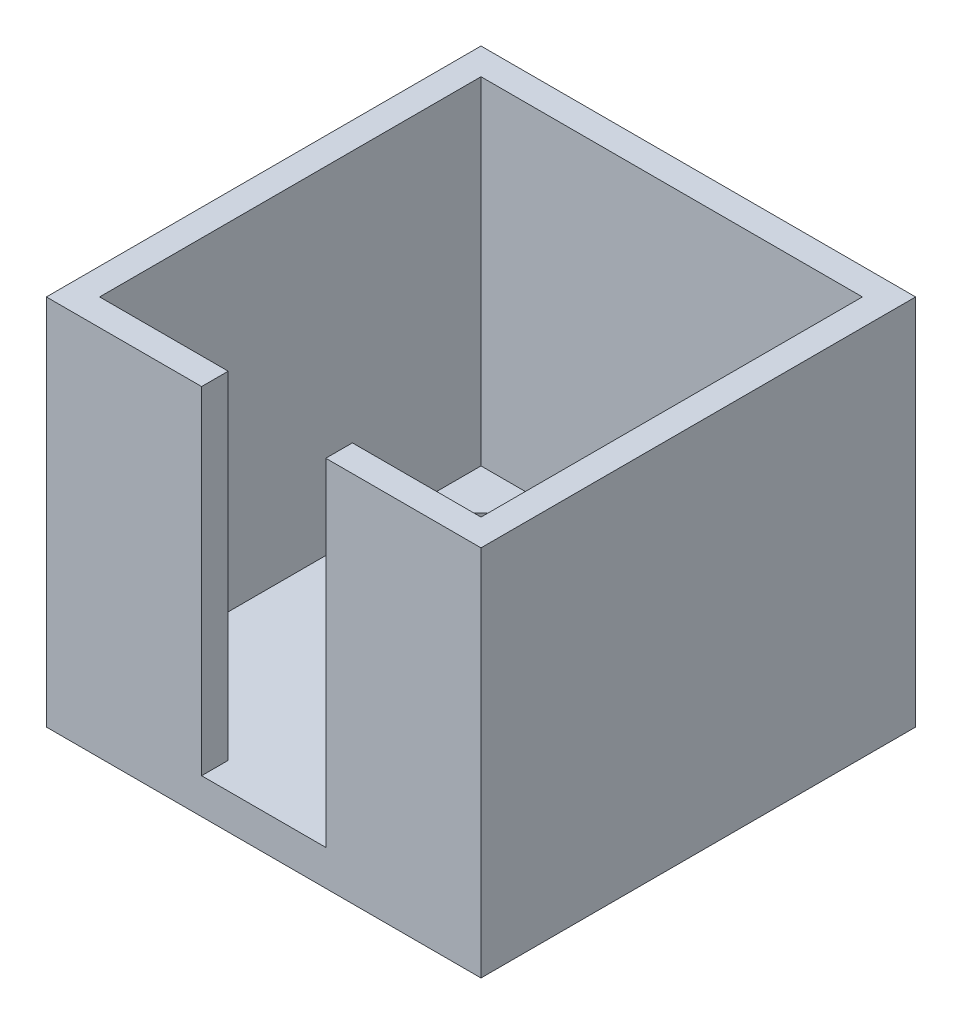
ISO-10303-21;
HEADER;
FILE_DESCRIPTION(('STEP AP214'),'2;1');
FILE_NAME('part.step','',(''),(''),'','','');
FILE_SCHEMA(('AUTOMOTIVE_DESIGN { 1 0 10303 214 1 1 1 1 }'));
ENDSEC;
DATA;
#1=APPLICATION_CONTEXT('core data for automotive mechanical design processes');
#2=APPLICATION_PROTOCOL_DEFINITION('international standard','automotive_design',2000,#1);
#3=PRODUCT_CONTEXT('',#1,'mechanical');
#4=PRODUCT('Part','Part','',(#3));
#5=PRODUCT_RELATED_PRODUCT_CATEGORY('part','',(#4));
#6=PRODUCT_DEFINITION_FORMATION('','',#4);
#7=PRODUCT_DEFINITION_CONTEXT('part definition',#1,'design');
#8=PRODUCT_DEFINITION('design','',#6,#7);
#9=PRODUCT_DEFINITION_SHAPE('','',#8);
#10=(LENGTH_UNIT() NAMED_UNIT(*) SI_UNIT(.MILLI.,.METRE.));
#11=(NAMED_UNIT(*) PLANE_ANGLE_UNIT() SI_UNIT($,.RADIAN.));
#12=(NAMED_UNIT(*) SI_UNIT($,.STERADIAN.) SOLID_ANGLE_UNIT());
#13=UNCERTAINTY_MEASURE_WITH_UNIT(LENGTH_MEASURE(1.E-05),#10,'distance_accuracy_value','');
#14=(GEOMETRIC_REPRESENTATION_CONTEXT(3) GLOBAL_UNCERTAINTY_ASSIGNED_CONTEXT((#13)) GLOBAL_UNIT_ASSIGNED_CONTEXT((#10,
#11,#12)) REPRESENTATION_CONTEXT('',''));
#15=CARTESIAN_POINT('',(0.,0.,0.));
#16=DIRECTION('',(0.,0.,1.));
#17=DIRECTION('',(1.,0.,0.));
#18=AXIS2_PLACEMENT_3D('',#15,#16,#17);
#19=CARTESIAN_POINT('',(14.5,0.,0.));
#20=DIRECTION('',(-1.,0.,0.));
#21=DIRECTION('',(0.,0.,1.));
#22=AXIS2_PLACEMENT_3D('',#19,#20,#21);
#23=PLANE('',#22);
#24=DIRECTION('',(0.,0.,-1.));
#25=VECTOR('',#24,1.);
#26=CARTESIAN_POINT('',(14.5,4.,3.));
#27=LINE('',#26,#25);
#28=CARTESIAN_POINT('',(14.5,4.,3.));
#29=VERTEX_POINT('',#28);
#30=CARTESIAN_POINT('',(14.5,4.,0.));
#31=VERTEX_POINT('',#30);
#32=EDGE_CURVE('E124',#29,#31,#27,.T.);
#33=ORIENTED_EDGE('',*,*,#32,.T.);
#34=DIRECTION('',(0.,-1.,0.));
#35=VECTOR('',#34,1.);
#36=CARTESIAN_POINT('',(14.5,0.,0.));
#37=LINE('',#36,#35);
#38=CARTESIAN_POINT('',(14.5,42.,0.));
#39=VERTEX_POINT('',#38);
#40=EDGE_CURVE('E120',#39,#31,#37,.T.);
#41=ORIENTED_EDGE('',*,*,#40,.F.);
#42=DIRECTION('',(0.,0.,1.));
#43=VECTOR('',#42,1.);
#44=CARTESIAN_POINT('',(14.5,42.,0.));
#45=LINE('',#44,#43);
#46=CARTESIAN_POINT('',(14.5,42.,3.));
#47=VERTEX_POINT('',#46);
#48=EDGE_CURVE('E122',#39,#47,#45,.T.);
#49=ORIENTED_EDGE('',*,*,#48,.T.);
#50=DIRECTION('',(0.,-1.,0.));
#51=VECTOR('',#50,1.);
#52=CARTESIAN_POINT('',(14.5,0.,3.));
#53=LINE('',#52,#51);
#54=EDGE_CURVE('E49',#47,#29,#53,.T.);
#55=ORIENTED_EDGE('',*,*,#54,.T.);
#56=EDGE_LOOP('',(#33,#41,#49,#55));
#57=FACE_BOUND('',#56,.T.);
#58=ADVANCED_FACE('F34',(#57),#23,.F.);
#59=CARTESIAN_POINT('',(28.5,0.,0.));
#60=DIRECTION('',(1.,0.,0.));
#61=DIRECTION('',(0.,0.,-1.));
#62=AXIS2_PLACEMENT_3D('',#59,#60,#61);
#63=PLANE('',#62);
#64=DIRECTION('',(0.,0.,-1.));
#65=VECTOR('',#64,1.);
#66=CARTESIAN_POINT('',(28.5,4.,3.));
#67=LINE('',#66,#65);
#68=CARTESIAN_POINT('',(28.5,4.,3.));
#69=VERTEX_POINT('',#68);
#70=CARTESIAN_POINT('',(28.5,4.,0.));
#71=VERTEX_POINT('',#70);
#72=EDGE_CURVE('E56',#69,#71,#67,.T.);
#73=ORIENTED_EDGE('',*,*,#72,.F.);
#74=DIRECTION('',(0.,1.,0.));
#75=VECTOR('',#74,1.);
#76=CARTESIAN_POINT('',(28.5,0.,3.));
#77=LINE('',#76,#75);
#78=CARTESIAN_POINT('',(28.5,42.,3.));
#79=VERTEX_POINT('',#78);
#80=EDGE_CURVE('E130',#69,#79,#77,.T.);
#81=ORIENTED_EDGE('',*,*,#80,.T.);
#82=DIRECTION('',(0.,0.,1.));
#83=VECTOR('',#82,1.);
#84=CARTESIAN_POINT('',(28.5,42.,0.));
#85=LINE('',#84,#83);
#86=CARTESIAN_POINT('',(28.5,42.,0.));
#87=VERTEX_POINT('',#86);
#88=EDGE_CURVE('E129',#87,#79,#85,.T.);
#89=ORIENTED_EDGE('',*,*,#88,.F.);
#90=DIRECTION('',(0.,-1.,0.));
#91=VECTOR('',#90,1.);
#92=CARTESIAN_POINT('',(28.5,42.,0.));
#93=LINE('',#92,#91);
#94=EDGE_CURVE('E11',#87,#71,#93,.T.);
#95=ORIENTED_EDGE('',*,*,#94,.T.);
#96=EDGE_LOOP('',(#73,#81,#89,#95));
#97=FACE_BOUND('',#96,.T.);
#98=ADVANCED_FACE('F264',(#97),#63,.F.);
#99=CARTESIAN_POINT('',(0.,42.,0.));
#100=DIRECTION('',(0.,0.,-1.));
#101=DIRECTION('',(-1.,0.,0.));
#102=AXIS2_PLACEMENT_3D('',#99,#100,#101);
#103=PLANE('',#102);
#104=ORIENTED_EDGE('',*,*,#40,.T.);
#105=DIRECTION('',(1.,0.,0.));
#106=VECTOR('',#105,1.);
#107=CARTESIAN_POINT('',(0.,4.,0.));
#108=LINE('',#107,#106);
#109=CARTESIAN_POINT('',(0.,4.,0.));
#110=VERTEX_POINT('',#109);
#111=EDGE_CURVE('E161',#110,#31,#108,.T.);
#112=ORIENTED_EDGE('',*,*,#111,.F.);
#113=DIRECTION('',(0.,-1.,0.));
#114=VECTOR('',#113,1.);
#115=CARTESIAN_POINT('',(0.,42.,0.));
#116=LINE('',#115,#114);
#117=CARTESIAN_POINT('',(0.,42.,0.));
#118=VERTEX_POINT('',#117);
#119=EDGE_CURVE('E146',#118,#110,#116,.T.);
#120=ORIENTED_EDGE('',*,*,#119,.F.);
#121=DIRECTION('',(1.,0.,0.));
#122=VECTOR('',#121,1.);
#123=CARTESIAN_POINT('',(0.,42.,0.));
#124=LINE('',#123,#122);
#125=EDGE_CURVE('E137',#118,#39,#124,.T.);
#126=ORIENTED_EDGE('',*,*,#125,.T.);
#127=EDGE_LOOP('',(#104,#112,#120,#126));
#128=FACE_BOUND('',#127,.T.);
#129=ADVANCED_FACE('F144',(#128),#103,.T.);
#130=CARTESIAN_POINT('',(46.,4.,0.));
#131=DIRECTION('',(1.,0.,0.));
#132=DIRECTION('',(0.,0.,-1.));
#133=AXIS2_PLACEMENT_3D('',#130,#131,#132);
#134=PLANE('',#133);
#135=DIRECTION('',(0.,0.,1.));
#136=VECTOR('',#135,1.);
#137=CARTESIAN_POINT('',(46.,0.,0.));
#138=LINE('',#137,#136);
#139=CARTESIAN_POINT('',(46.,0.,-46.));
#140=VERTEX_POINT('',#139);
#141=CARTESIAN_POINT('',(46.,0.,3.));
#142=VERTEX_POINT('',#141);
#143=EDGE_CURVE('E200',#140,#142,#138,.T.);
#144=ORIENTED_EDGE('',*,*,#143,.F.);
#145=DIRECTION('',(0.,-1.,0.));
#146=VECTOR('',#145,1.);
#147=CARTESIAN_POINT('',(46.,4.,-46.));
#148=LINE('',#147,#146);
#149=CARTESIAN_POINT('',(46.,42.,-46.));
#150=VERTEX_POINT('',#149);
#151=EDGE_CURVE('E42',#150,#140,#148,.T.);
#152=ORIENTED_EDGE('',*,*,#151,.F.);
#153=DIRECTION('',(0.,0.,-1.));
#154=VECTOR('',#153,1.);
#155=CARTESIAN_POINT('',(46.,42.,-46.));
#156=LINE('',#155,#154);
#157=CARTESIAN_POINT('',(46.,42.,3.));
#158=VERTEX_POINT('',#157);
#159=EDGE_CURVE('E180',#158,#150,#156,.T.);
#160=ORIENTED_EDGE('',*,*,#159,.F.);
#161=DIRECTION('',(0.,-1.,0.));
#162=VECTOR('',#161,1.);
#163=CARTESIAN_POINT('',(46.,4.,3.));
#164=LINE('',#163,#162);
#165=EDGE_CURVE('E194',#158,#142,#164,.T.);
#166=ORIENTED_EDGE('',*,*,#165,.T.);
#167=EDGE_LOOP('',(#144,#152,#160,#166));
#168=FACE_BOUND('',#167,.T.);
#169=ADVANCED_FACE('F223',(#168),#134,.T.);
#170=CARTESIAN_POINT('',(0.,4.,-46.));
#171=DIRECTION('',(0.,0.,-1.));
#172=DIRECTION('',(-1.,0.,0.));
#173=AXIS2_PLACEMENT_3D('',#170,#171,#172);
#174=PLANE('',#173);
#175=DIRECTION('',(1.,0.,0.));
#176=VECTOR('',#175,1.);
#177=CARTESIAN_POINT('',(0.,0.,-46.));
#178=LINE('',#177,#176);
#179=CARTESIAN_POINT('',(-3.,0.,-46.));
#180=VERTEX_POINT('',#179);
#181=EDGE_CURVE('E203',#180,#140,#178,.T.);
#182=ORIENTED_EDGE('',*,*,#181,.F.);
#183=DIRECTION('',(0.,-1.,0.));
#184=VECTOR('',#183,1.);
#185=CARTESIAN_POINT('',(-3.,4.,-46.));
#186=LINE('',#185,#184);
#187=CARTESIAN_POINT('',(-3.,42.,-46.));
#188=VERTEX_POINT('',#187);
#189=EDGE_CURVE('E215',#188,#180,#186,.T.);
#190=ORIENTED_EDGE('',*,*,#189,.F.);
#191=DIRECTION('',(-1.,0.,0.));
#192=VECTOR('',#191,1.);
#193=CARTESIAN_POINT('',(-3.,42.,-46.));
#194=LINE('',#193,#192);
#195=EDGE_CURVE('E183',#150,#188,#194,.T.);
#196=ORIENTED_EDGE('',*,*,#195,.F.);
#197=ORIENTED_EDGE('',*,*,#151,.T.);
#198=EDGE_LOOP('',(#182,#190,#196,#197));
#199=FACE_BOUND('',#198,.T.);
#200=ADVANCED_FACE('F220',(#199),#174,.T.);
#201=CARTESIAN_POINT('',(-3.,4.,0.));
#202=DIRECTION('',(1.,0.,0.));
#203=DIRECTION('',(0.,0.,-1.));
#204=AXIS2_PLACEMENT_3D('',#201,#202,#203);
#205=PLANE('',#204);
#206=DIRECTION('',(0.,0.,1.));
#207=VECTOR('',#206,1.);
#208=CARTESIAN_POINT('',(-3.,0.,0.));
#209=LINE('',#208,#207);
#210=CARTESIAN_POINT('',(-3.,0.,3.));
#211=VERTEX_POINT('',#210);
#212=EDGE_CURVE('E206',#180,#211,#209,.T.);
#213=ORIENTED_EDGE('',*,*,#212,.T.);
#214=DIRECTION('',(0.,-1.,0.));
#215=VECTOR('',#214,1.);
#216=CARTESIAN_POINT('',(-3.,4.,3.));
#217=LINE('',#216,#215);
#218=CARTESIAN_POINT('',(-3.,42.,3.));
#219=VERTEX_POINT('',#218);
#220=EDGE_CURVE('E212',#219,#211,#217,.T.);
#221=ORIENTED_EDGE('',*,*,#220,.F.);
#222=DIRECTION('',(0.,0.,1.));
#223=VECTOR('',#222,1.);
#224=CARTESIAN_POINT('',(-3.,42.,-46.));
#225=LINE('',#224,#223);
#226=EDGE_CURVE('E176',#188,#219,#225,.T.);
#227=ORIENTED_EDGE('',*,*,#226,.F.);
#228=ORIENTED_EDGE('',*,*,#189,.T.);
#229=EDGE_LOOP('',(#213,#221,#227,#228));
#230=FACE_BOUND('',#229,.T.);
#231=ADVANCED_FACE('F230',(#230),#205,.F.);
#232=CARTESIAN_POINT('',(7.07106781186548,4.,-35.9289321881345));
#233=DIRECTION('',(0.,-1.,0.));
#234=DIRECTION('',(0.,0.,-1.));
#235=AXIS2_PLACEMENT_3D('',#232,#233,#234);
#236=CYLINDRICAL_SURFACE('',#235,3.5);
#237=CARTESIAN_POINT('',(7.07106781186548,4.,-35.9289321881345));
#238=DIRECTION('',(0.,1.,0.));
#239=DIRECTION('',(0.,0.,1.));
#240=AXIS2_PLACEMENT_3D('',#237,#238,#239);
#241=CIRCLE('',#240,3.5);
#242=CARTESIAN_POINT('',(7.07106781186548,4.,-32.4289321881345));
#243=VERTEX_POINT('',#242);
#244=EDGE_CURVE('E190',#243,#243,#241,.T.);
#245=ORIENTED_EDGE('',*,*,#244,.T.);
#246=EDGE_LOOP('',(#245));
#247=FACE_BOUND('',#246,.T.);
#248=CARTESIAN_POINT('',(7.07106781186548,0.,-35.9289321881345));
#249=DIRECTION('',(0.,1.,0.));
#250=DIRECTION('',(0.,0.,1.));
#251=AXIS2_PLACEMENT_3D('',#248,#249,#250);
#252=CIRCLE('',#251,3.5);
#253=CARTESIAN_POINT('',(7.07106781186548,0.,-32.4289321881345));
#254=VERTEX_POINT('',#253);
#255=EDGE_CURVE('E197',#254,#254,#252,.T.);
#256=ORIENTED_EDGE('',*,*,#255,.F.);
#257=EDGE_LOOP('',(#256));
#258=FACE_BOUND('',#257,.T.);
#259=ADVANCED_FACE('F291',(#247,#258),#236,.F.);
#260=CARTESIAN_POINT('',(35.9289321881345,4.,-7.07106781186547));
#261=DIRECTION('',(0.,-1.,0.));
#262=DIRECTION('',(0.,0.,-1.));
#263=AXIS2_PLACEMENT_3D('',#260,#261,#262);
#264=CYLINDRICAL_SURFACE('',#263,3.5);
#265=CARTESIAN_POINT('',(35.9289321881345,4.,-7.07106781186547));
#266=DIRECTION('',(0.,1.,0.));
#267=DIRECTION('',(0.,0.,1.));
#268=AXIS2_PLACEMENT_3D('',#265,#266,#267);
#269=CIRCLE('',#268,3.5);
#270=CARTESIAN_POINT('',(35.9289321881345,4.,-3.57106781186547));
#271=VERTEX_POINT('',#270);
#272=EDGE_CURVE('E187',#271,#271,#269,.T.);
#273=ORIENTED_EDGE('',*,*,#272,.T.);
#274=EDGE_LOOP('',(#273));
#275=FACE_BOUND('',#274,.T.);
#276=CARTESIAN_POINT('',(35.9289321881345,0.,-7.07106781186547));
#277=DIRECTION('',(0.,1.,0.));
#278=DIRECTION('',(0.,0.,1.));
#279=AXIS2_PLACEMENT_3D('',#276,#277,#278);
#280=CIRCLE('',#279,3.5);
#281=CARTESIAN_POINT('',(35.9289321881345,0.,-3.57106781186547));
#282=VERTEX_POINT('',#281);
#283=EDGE_CURVE('E186',#282,#282,#280,.T.);
#284=ORIENTED_EDGE('',*,*,#283,.F.);
#285=EDGE_LOOP('',(#284));
#286=FACE_BOUND('',#285,.T.);
#287=ADVANCED_FACE('F36',(#275,#286),#264,.F.);
#288=CARTESIAN_POINT('',(0.,4.,3.));
#289=DIRECTION('',(0.,0.,-1.));
#290=DIRECTION('',(-1.,0.,0.));
#291=AXIS2_PLACEMENT_3D('',#288,#289,#290);
#292=PLANE('',#291);
#293=DIRECTION('',(1.,0.,0.));
#294=VECTOR('',#293,1.);
#295=CARTESIAN_POINT('',(-3.,42.,3.));
#296=LINE('',#295,#294);
#297=EDGE_CURVE('E178',#79,#158,#296,.T.);
#298=ORIENTED_EDGE('',*,*,#297,.F.);
#299=ORIENTED_EDGE('',*,*,#80,.F.);
#300=DIRECTION('',(-1.,0.,0.));
#301=VECTOR('',#300,1.);
#302=CARTESIAN_POINT('',(28.5,4.,3.));
#303=LINE('',#302,#301);
#304=EDGE_CURVE('E238',#69,#29,#303,.T.);
#305=ORIENTED_EDGE('',*,*,#304,.T.);
#306=ORIENTED_EDGE('',*,*,#54,.F.);
#307=EDGE_CURVE('E140',#219,#47,#296,.T.);
#308=ORIENTED_EDGE('',*,*,#307,.F.);
#309=ORIENTED_EDGE('',*,*,#220,.T.);
#310=DIRECTION('',(1.,0.,0.));
#311=VECTOR('',#310,1.);
#312=CARTESIAN_POINT('',(0.,0.,3.));
#313=LINE('',#312,#311);
#314=EDGE_CURVE('E191',#211,#142,#313,.T.);
#315=ORIENTED_EDGE('',*,*,#314,.T.);
#316=ORIENTED_EDGE('',*,*,#165,.F.);
#317=EDGE_LOOP('',(#298,#299,#305,#306,#308,#309,#315,#316));
#318=FACE_BOUND('',#317,.T.);
#319=ADVANCED_FACE('F236',(#318),#292,.F.);
#320=CARTESIAN_POINT('',(0.,4.,0.));
#321=DIRECTION('',(0.,1.,0.));
#322=DIRECTION('',(0.,0.,1.));
#323=AXIS2_PLACEMENT_3D('',#320,#321,#322);
#324=PLANE('',#323);
#325=DIRECTION('',(0.,0.,1.));
#326=VECTOR('',#325,1.);
#327=CARTESIAN_POINT('',(0.,4.,-43.));
#328=LINE('',#327,#326);
#329=CARTESIAN_POINT('',(0.,4.,-43.));
#330=VERTEX_POINT('',#329);
#331=EDGE_CURVE('E141',#330,#110,#328,.T.);
#332=ORIENTED_EDGE('',*,*,#331,.T.);
#333=ORIENTED_EDGE('',*,*,#111,.T.);
#334=ORIENTED_EDGE('',*,*,#32,.F.);
#335=ORIENTED_EDGE('',*,*,#304,.F.);
#336=ORIENTED_EDGE('',*,*,#72,.T.);
#337=CARTESIAN_POINT('',(43.,4.,0.));
#338=VERTEX_POINT('',#337);
#339=EDGE_CURVE('E160',#71,#338,#108,.T.);
#340=ORIENTED_EDGE('',*,*,#339,.T.);
#341=DIRECTION('',(0.,0.,-1.));
#342=VECTOR('',#341,1.);
#343=CARTESIAN_POINT('',(43.,4.,-43.));
#344=LINE('',#343,#342);
#345=CARTESIAN_POINT('',(43.,4.,-43.));
#346=VERTEX_POINT('',#345);
#347=EDGE_CURVE('E163',#338,#346,#344,.T.);
#348=ORIENTED_EDGE('',*,*,#347,.T.);
#349=DIRECTION('',(-1.,0.,0.));
#350=VECTOR('',#349,1.);
#351=CARTESIAN_POINT('',(0.,4.,-43.));
#352=LINE('',#351,#350);
#353=EDGE_CURVE('E165',#346,#330,#352,.T.);
#354=ORIENTED_EDGE('',*,*,#353,.T.);
#355=EDGE_LOOP('',(#332,#333,#334,#335,#336,#340,#348,#354));
#356=FACE_BOUND('',#355,.T.);
#357=ORIENTED_EDGE('',*,*,#272,.F.);
#358=EDGE_LOOP('',(#357));
#359=FACE_BOUND('',#358,.T.);
#360=ORIENTED_EDGE('',*,*,#244,.F.);
#361=EDGE_LOOP('',(#360));
#362=FACE_BOUND('',#361,.T.);
#363=ADVANCED_FACE('F245',(#356,#359,#362),#324,.T.);
#364=CARTESIAN_POINT('',(0.,0.,0.));
#365=DIRECTION('',(0.,1.,0.));
#366=DIRECTION('',(0.,0.,1.));
#367=AXIS2_PLACEMENT_3D('',#364,#365,#366);
#368=PLANE('',#367);
#369=ORIENTED_EDGE('',*,*,#143,.T.);
#370=ORIENTED_EDGE('',*,*,#314,.F.);
#371=ORIENTED_EDGE('',*,*,#212,.F.);
#372=ORIENTED_EDGE('',*,*,#181,.T.);
#373=EDGE_LOOP('',(#369,#370,#371,#372));
#374=FACE_BOUND('',#373,.T.);
#375=ORIENTED_EDGE('',*,*,#283,.T.);
#376=EDGE_LOOP('',(#375));
#377=FACE_BOUND('',#376,.T.);
#378=ORIENTED_EDGE('',*,*,#255,.T.);
#379=EDGE_LOOP('',(#378));
#380=FACE_BOUND('',#379,.T.);
#381=ADVANCED_FACE('F227',(#374,#377,#380),#368,.F.);
#382=CARTESIAN_POINT('',(0.,42.,0.));
#383=DIRECTION('',(0.,1.,0.));
#384=DIRECTION('',(0.,0.,1.));
#385=AXIS2_PLACEMENT_3D('',#382,#383,#384);
#386=PLANE('',#385);
#387=ORIENTED_EDGE('',*,*,#48,.F.);
#388=ORIENTED_EDGE('',*,*,#125,.F.);
#389=DIRECTION('',(0.,0.,1.));
#390=VECTOR('',#389,1.);
#391=CARTESIAN_POINT('',(0.,42.,-43.));
#392=LINE('',#391,#390);
#393=CARTESIAN_POINT('',(0.,42.,-43.));
#394=VERTEX_POINT('',#393);
#395=EDGE_CURVE('E153',#394,#118,#392,.T.);
#396=ORIENTED_EDGE('',*,*,#395,.F.);
#397=DIRECTION('',(-1.,0.,0.));
#398=VECTOR('',#397,1.);
#399=CARTESIAN_POINT('',(0.,42.,-43.));
#400=LINE('',#399,#398);
#401=CARTESIAN_POINT('',(43.,42.,-43.));
#402=VERTEX_POINT('',#401);
#403=EDGE_CURVE('E151',#402,#394,#400,.T.);
#404=ORIENTED_EDGE('',*,*,#403,.F.);
#405=DIRECTION('',(0.,0.,-1.));
#406=VECTOR('',#405,1.);
#407=CARTESIAN_POINT('',(43.,42.,-43.));
#408=LINE('',#407,#406);
#409=CARTESIAN_POINT('',(43.,42.,0.));
#410=VERTEX_POINT('',#409);
#411=EDGE_CURVE('E147',#410,#402,#408,.T.);
#412=ORIENTED_EDGE('',*,*,#411,.F.);
#413=EDGE_CURVE('E148',#87,#410,#124,.T.);
#414=ORIENTED_EDGE('',*,*,#413,.F.);
#415=ORIENTED_EDGE('',*,*,#88,.T.);
#416=ORIENTED_EDGE('',*,*,#297,.T.);
#417=ORIENTED_EDGE('',*,*,#159,.T.);
#418=ORIENTED_EDGE('',*,*,#195,.T.);
#419=ORIENTED_EDGE('',*,*,#226,.T.);
#420=ORIENTED_EDGE('',*,*,#307,.T.);
#421=EDGE_LOOP('',(#387,#388,#396,#404,#412,#414,#415,#416,#417,#418,#419,#420));
#422=FACE_BOUND('',#421,.T.);
#423=ADVANCED_FACE('F135',(#422),#386,.T.);
#424=CARTESIAN_POINT('',(0.,42.,-43.));
#425=DIRECTION('',(1.,0.,0.));
#426=DIRECTION('',(0.,0.,-1.));
#427=AXIS2_PLACEMENT_3D('',#424,#425,#426);
#428=PLANE('',#427);
#429=ORIENTED_EDGE('',*,*,#331,.F.);
#430=DIRECTION('',(0.,-1.,0.));
#431=VECTOR('',#430,1.);
#432=CARTESIAN_POINT('',(0.,42.,-43.));
#433=LINE('',#432,#431);
#434=EDGE_CURVE('E158',#394,#330,#433,.T.);
#435=ORIENTED_EDGE('',*,*,#434,.F.);
#436=ORIENTED_EDGE('',*,*,#395,.T.);
#437=ORIENTED_EDGE('',*,*,#119,.T.);
#438=EDGE_LOOP('',(#429,#435,#436,#437));
#439=FACE_BOUND('',#438,.T.);
#440=ADVANCED_FACE('F250',(#439),#428,.T.);
#441=ORIENTED_EDGE('',*,*,#94,.F.);
#442=ORIENTED_EDGE('',*,*,#413,.T.);
#443=DIRECTION('',(0.,-1.,0.));
#444=VECTOR('',#443,1.);
#445=CARTESIAN_POINT('',(43.,42.,0.));
#446=LINE('',#445,#444);
#447=EDGE_CURVE('E172',#410,#338,#446,.T.);
#448=ORIENTED_EDGE('',*,*,#447,.T.);
#449=ORIENTED_EDGE('',*,*,#339,.F.);
#450=EDGE_LOOP('',(#441,#442,#448,#449));
#451=FACE_BOUND('',#450,.T.);
#452=ADVANCED_FACE('F263',(#451),#103,.T.);
#453=CARTESIAN_POINT('',(43.,42.,-43.));
#454=DIRECTION('',(-1.,0.,0.));
#455=DIRECTION('',(0.,0.,1.));
#456=AXIS2_PLACEMENT_3D('',#453,#454,#455);
#457=PLANE('',#456);
#458=ORIENTED_EDGE('',*,*,#347,.F.);
#459=ORIENTED_EDGE('',*,*,#447,.F.);
#460=ORIENTED_EDGE('',*,*,#411,.T.);
#461=DIRECTION('',(0.,-1.,0.));
#462=VECTOR('',#461,1.);
#463=CARTESIAN_POINT('',(43.,42.,-43.));
#464=LINE('',#463,#462);
#465=EDGE_CURVE('E169',#402,#346,#464,.T.);
#466=ORIENTED_EDGE('',*,*,#465,.T.);
#467=EDGE_LOOP('',(#458,#459,#460,#466));
#468=FACE_BOUND('',#467,.T.);
#469=ADVANCED_FACE('F260',(#468),#457,.T.);
#470=CARTESIAN_POINT('',(0.,42.,-43.));
#471=DIRECTION('',(0.,0.,1.));
#472=DIRECTION('',(1.,0.,0.));
#473=AXIS2_PLACEMENT_3D('',#470,#471,#472);
#474=PLANE('',#473);
#475=ORIENTED_EDGE('',*,*,#353,.F.);
#476=ORIENTED_EDGE('',*,*,#465,.F.);
#477=ORIENTED_EDGE('',*,*,#403,.T.);
#478=ORIENTED_EDGE('',*,*,#434,.T.);
#479=EDGE_LOOP('',(#475,#476,#477,#478));
#480=FACE_BOUND('',#479,.T.);
#481=ADVANCED_FACE('F256',(#480),#474,.T.);
#482=CLOSED_SHELL('',(#58,#98,#129,#169,#200,#231,#259,#287,#319,#363,#381,#423,#440,#452,#469,#481));
#483=MANIFOLD_SOLID_BREP('B2',#482);
#484=ADVANCED_BREP_SHAPE_REPRESENTATION('',(#18,#483),#14);
#485=SHAPE_DEFINITION_REPRESENTATION(#9,#484);
ENDSEC;
END-ISO-10303-21;
